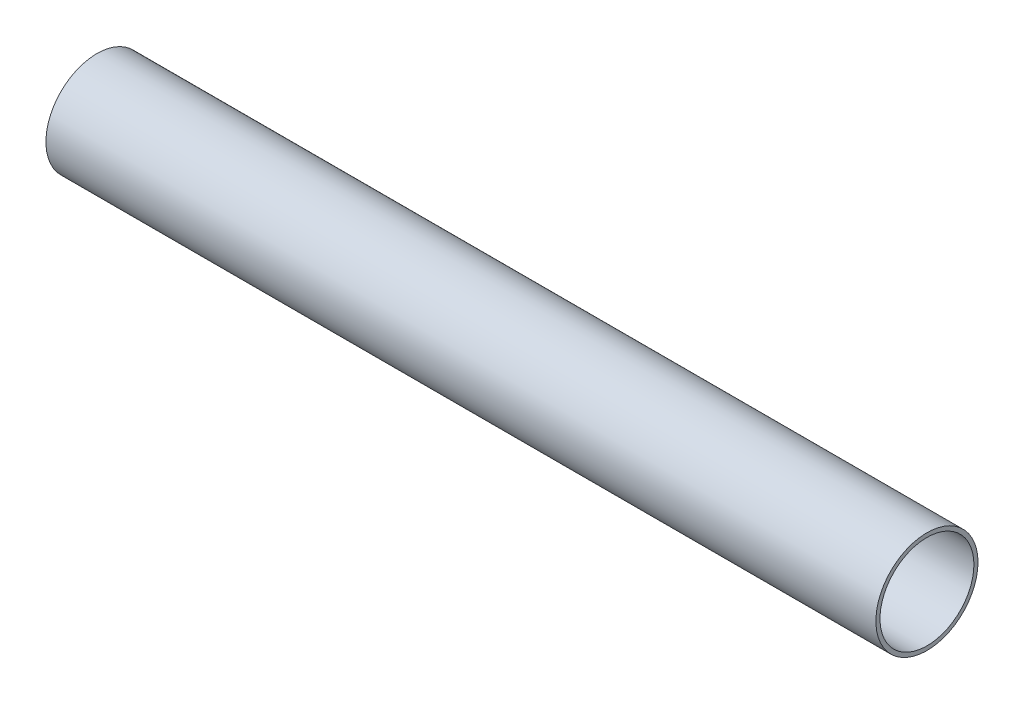
ISO-10303-21;
HEADER;
FILE_DESCRIPTION(('STEP AP214'),'2;1');
FILE_NAME('part.step','',(''),(''),'','','');
FILE_SCHEMA(('AUTOMOTIVE_DESIGN { 1 0 10303 214 1 1 1 1 }'));
ENDSEC;
DATA;
#1=APPLICATION_CONTEXT('core data for automotive mechanical design processes');
#2=APPLICATION_PROTOCOL_DEFINITION('international standard','automotive_design',2000,#1);
#3=PRODUCT_CONTEXT('',#1,'mechanical');
#4=PRODUCT('Part','Part','',(#3));
#5=PRODUCT_RELATED_PRODUCT_CATEGORY('part','',(#4));
#6=PRODUCT_DEFINITION_FORMATION('','',#4);
#7=PRODUCT_DEFINITION_CONTEXT('part definition',#1,'design');
#8=PRODUCT_DEFINITION('design','',#6,#7);
#9=PRODUCT_DEFINITION_SHAPE('','',#8);
#10=(LENGTH_UNIT() NAMED_UNIT(*) SI_UNIT(.MILLI.,.METRE.));
#11=(NAMED_UNIT(*) PLANE_ANGLE_UNIT() SI_UNIT($,.RADIAN.));
#12=(NAMED_UNIT(*) SI_UNIT($,.STERADIAN.) SOLID_ANGLE_UNIT());
#13=UNCERTAINTY_MEASURE_WITH_UNIT(LENGTH_MEASURE(1.E-05),#10,'distance_accuracy_value','');
#14=(GEOMETRIC_REPRESENTATION_CONTEXT(3) GLOBAL_UNCERTAINTY_ASSIGNED_CONTEXT((#13)) GLOBAL_UNIT_ASSIGNED_CONTEXT((#10,
#11,#12)) REPRESENTATION_CONTEXT('',''));
#15=CARTESIAN_POINT('',(0.,0.,0.));
#16=DIRECTION('',(0.,0.,1.));
#17=DIRECTION('',(1.,0.,0.));
#18=AXIS2_PLACEMENT_3D('',#15,#16,#17);
#19=CARTESIAN_POINT('',(203.2,0.,0.));
#20=DIRECTION('',(1.,0.,0.));
#21=DIRECTION('',(0.,0.,-1.));
#22=AXIS2_PLACEMENT_3D('',#19,#20,#21);
#23=PLANE('',#22);
#24=CARTESIAN_POINT('',(203.2,0.,0.));
#25=DIRECTION('',(1.,0.,0.));
#26=DIRECTION('',(0.,0.,-1.));
#27=AXIS2_PLACEMENT_3D('',#24,#25,#26);
#28=CIRCLE('',#27,12.5);
#29=CARTESIAN_POINT('',(203.2,0.,-12.5));
#30=VERTEX_POINT('',#29);
#31=EDGE_CURVE('E10',#30,#30,#28,.T.);
#32=ORIENTED_EDGE('',*,*,#31,.T.);
#33=EDGE_LOOP('',(#32));
#34=FACE_BOUND('',#33,.T.);
#35=CARTESIAN_POINT('',(203.2,0.,0.));
#36=DIRECTION('',(1.,0.,0.));
#37=DIRECTION('',(0.,0.,-1.));
#38=AXIS2_PLACEMENT_3D('',#35,#36,#37);
#39=CIRCLE('',#38,11.5);
#40=CARTESIAN_POINT('',(203.2,0.,-11.5));
#41=VERTEX_POINT('',#40);
#42=EDGE_CURVE('E54',#41,#41,#39,.T.);
#43=ORIENTED_EDGE('',*,*,#42,.F.);
#44=EDGE_LOOP('',(#43));
#45=FACE_BOUND('',#44,.T.);
#46=ADVANCED_FACE('F43',(#34,#45),#23,.T.);
#47=CARTESIAN_POINT('',(0.,0.,0.));
#48=DIRECTION('',(1.,0.,0.));
#49=DIRECTION('',(0.,0.,-1.));
#50=AXIS2_PLACEMENT_3D('',#47,#48,#49);
#51=PLANE('',#50);
#52=CARTESIAN_POINT('',(0.,0.,0.));
#53=DIRECTION('',(1.,0.,0.));
#54=DIRECTION('',(0.,0.,-1.));
#55=AXIS2_PLACEMENT_3D('',#52,#53,#54);
#56=CIRCLE('',#55,12.5);
#57=CARTESIAN_POINT('',(0.,0.,-12.5));
#58=VERTEX_POINT('',#57);
#59=EDGE_CURVE('E47',#58,#58,#56,.T.);
#60=ORIENTED_EDGE('',*,*,#59,.F.);
#61=EDGE_LOOP('',(#60));
#62=FACE_BOUND('',#61,.T.);
#63=CARTESIAN_POINT('',(0.,0.,0.));
#64=DIRECTION('',(1.,0.,0.));
#65=DIRECTION('',(0.,0.,-1.));
#66=AXIS2_PLACEMENT_3D('',#63,#64,#65);
#67=CIRCLE('',#66,11.5);
#68=CARTESIAN_POINT('',(0.,0.,-11.5));
#69=VERTEX_POINT('',#68);
#70=EDGE_CURVE('E56',#69,#69,#67,.T.);
#71=ORIENTED_EDGE('',*,*,#70,.T.);
#72=EDGE_LOOP('',(#71));
#73=FACE_BOUND('',#72,.T.);
#74=ADVANCED_FACE('F66',(#62,#73),#51,.F.);
#75=CARTESIAN_POINT('',(203.2,0.,0.));
#76=DIRECTION('',(-1.,0.,0.));
#77=DIRECTION('',(0.,0.,1.));
#78=AXIS2_PLACEMENT_3D('',#75,#76,#77);
#79=CYLINDRICAL_SURFACE('',#78,12.5);
#80=ORIENTED_EDGE('',*,*,#31,.F.);
#81=EDGE_LOOP('',(#80));
#82=FACE_BOUND('',#81,.T.);
#83=ORIENTED_EDGE('',*,*,#59,.T.);
#84=EDGE_LOOP('',(#83));
#85=FACE_BOUND('',#84,.T.);
#86=ADVANCED_FACE('F45',(#82,#85),#79,.T.);
#87=CARTESIAN_POINT('',(203.2,0.,0.));
#88=DIRECTION('',(-1.,0.,0.));
#89=DIRECTION('',(0.,0.,1.));
#90=AXIS2_PLACEMENT_3D('',#87,#88,#89);
#91=CYLINDRICAL_SURFACE('',#90,11.5);
#92=ORIENTED_EDGE('',*,*,#42,.T.);
#93=EDGE_LOOP('',(#92));
#94=FACE_BOUND('',#93,.T.);
#95=ORIENTED_EDGE('',*,*,#70,.F.);
#96=EDGE_LOOP('',(#95));
#97=FACE_BOUND('',#96,.T.);
#98=ADVANCED_FACE('F62',(#94,#97),#91,.F.);
#99=CLOSED_SHELL('',(#46,#74,#86,#98));
#100=MANIFOLD_SOLID_BREP('B2',#99);
#101=ADVANCED_BREP_SHAPE_REPRESENTATION('',(#18,#100),#14);
#102=SHAPE_DEFINITION_REPRESENTATION(#9,#101);
ENDSEC;
END-ISO-10303-21;
